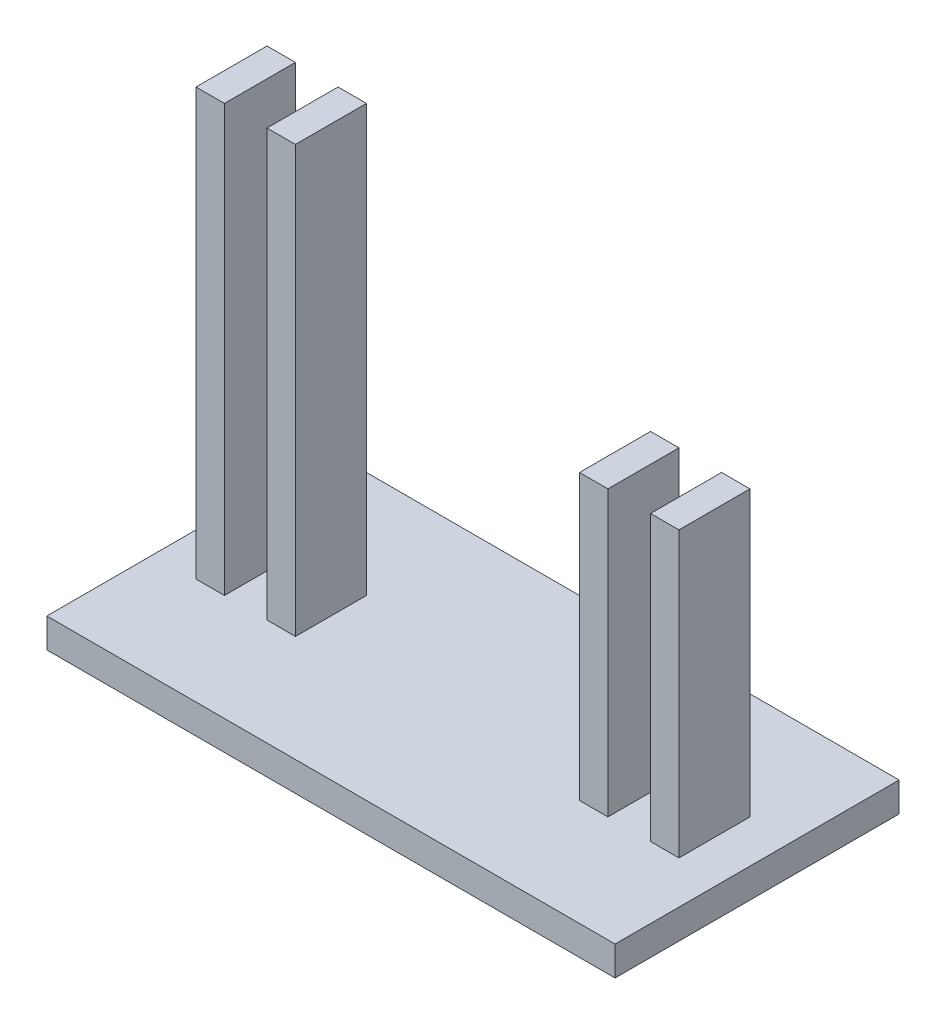
ISO-10303-21;
HEADER;
FILE_DESCRIPTION(('STEP AP214'),'2;1');
FILE_NAME('part.step','',(''),(''),'','','');
FILE_SCHEMA(('AUTOMOTIVE_DESIGN { 1 0 10303 214 1 1 1 1 }'));
ENDSEC;
DATA;
#1=APPLICATION_CONTEXT('core data for automotive mechanical design processes');
#2=APPLICATION_PROTOCOL_DEFINITION('international standard','automotive_design',2000,#1);
#3=PRODUCT_CONTEXT('',#1,'mechanical');
#4=PRODUCT('Part','Part','',(#3));
#5=PRODUCT_RELATED_PRODUCT_CATEGORY('part','',(#4));
#6=PRODUCT_DEFINITION_FORMATION('','',#4);
#7=PRODUCT_DEFINITION_CONTEXT('part definition',#1,'design');
#8=PRODUCT_DEFINITION('design','',#6,#7);
#9=PRODUCT_DEFINITION_SHAPE('','',#8);
#10=(LENGTH_UNIT() NAMED_UNIT(*) SI_UNIT(.MILLI.,.METRE.));
#11=(NAMED_UNIT(*) PLANE_ANGLE_UNIT() SI_UNIT($,.RADIAN.));
#12=(NAMED_UNIT(*) SI_UNIT($,.STERADIAN.) SOLID_ANGLE_UNIT());
#13=UNCERTAINTY_MEASURE_WITH_UNIT(LENGTH_MEASURE(1.E-05),#10,'distance_accuracy_value','');
#14=(GEOMETRIC_REPRESENTATION_CONTEXT(3) GLOBAL_UNCERTAINTY_ASSIGNED_CONTEXT((#13)) GLOBAL_UNIT_ASSIGNED_CONTEXT((#10,
#11,#12)) REPRESENTATION_CONTEXT('',''));
#15=CARTESIAN_POINT('',(0.,0.,0.));
#16=DIRECTION('',(0.,0.,1.));
#17=DIRECTION('',(1.,0.,0.));
#18=AXIS2_PLACEMENT_3D('',#15,#16,#17);
#19=CARTESIAN_POINT('',(0.,10.3577426791042,0.));
#20=DIRECTION('',(0.,1.,0.));
#21=DIRECTION('',(0.,0.,1.));
#22=AXIS2_PLACEMENT_3D('',#19,#20,#21);
#23=PLANE('',#22);
#24=DIRECTION('',(1.,0.,0.));
#25=VECTOR('',#24,1.);
#26=CARTESIAN_POINT('',(-100.,10.3577426791042,50.));
#27=LINE('',#26,#25);
#28=CARTESIAN_POINT('',(-100.,10.3577426791042,50.));
#29=VERTEX_POINT('',#28);
#30=CARTESIAN_POINT('',(100.,10.3577426791042,50.));
#31=VERTEX_POINT('',#30);
#32=EDGE_CURVE('E285',#29,#31,#27,.T.);
#33=ORIENTED_EDGE('',*,*,#32,.T.);
#34=DIRECTION('',(0.,0.,-1.));
#35=VECTOR('',#34,1.);
#36=CARTESIAN_POINT('',(100.,10.3577426791042,50.));
#37=LINE('',#36,#35);
#38=CARTESIAN_POINT('',(100.,10.3577426791042,-50.));
#39=VERTEX_POINT('',#38);
#40=EDGE_CURVE('E288',#31,#39,#37,.T.);
#41=ORIENTED_EDGE('',*,*,#40,.T.);
#42=DIRECTION('',(-1.,0.,0.));
#43=VECTOR('',#42,1.);
#44=CARTESIAN_POINT('',(-100.,10.3577426791042,-50.));
#45=LINE('',#44,#43);
#46=CARTESIAN_POINT('',(-100.,10.3577426791042,-50.));
#47=VERTEX_POINT('',#46);
#48=EDGE_CURVE('E291',#39,#47,#45,.T.);
#49=ORIENTED_EDGE('',*,*,#48,.T.);
#50=DIRECTION('',(0.,0.,1.));
#51=VECTOR('',#50,1.);
#52=CARTESIAN_POINT('',(-100.,10.3577426791042,-50.));
#53=LINE('',#52,#51);
#54=EDGE_CURVE('E293',#47,#29,#53,.T.);
#55=ORIENTED_EDGE('',*,*,#54,.T.);
#56=EDGE_LOOP('',(#33,#41,#49,#55));
#57=FACE_BOUND('',#56,.T.);
#58=DIRECTION('',(0.,0.,1.));
#59=VECTOR('',#58,1.);
#60=CARTESIAN_POINT('',(-85.,10.3577426791042,-12.5));
#61=LINE('',#60,#59);
#62=CARTESIAN_POINT('',(-85.,10.3577426791042,-12.5));
#63=VERTEX_POINT('',#62);
#64=CARTESIAN_POINT('',(-85.,10.3577426791042,12.5));
#65=VERTEX_POINT('',#64);
#66=EDGE_CURVE('E269',#63,#65,#61,.T.);
#67=ORIENTED_EDGE('',*,*,#66,.F.);
#68=DIRECTION('',(-1.,0.,0.));
#69=VECTOR('',#68,1.);
#70=CARTESIAN_POINT('',(-75.,10.3577426791042,-12.5));
#71=LINE('',#70,#69);
#72=CARTESIAN_POINT('',(-75.,10.3577426791042,-12.5));
#73=VERTEX_POINT('',#72);
#74=EDGE_CURVE('E255',#73,#63,#71,.T.);
#75=ORIENTED_EDGE('',*,*,#74,.F.);
#76=DIRECTION('',(0.,0.,-1.));
#77=VECTOR('',#76,1.);
#78=CARTESIAN_POINT('',(-75.,10.3577426791042,-12.5));
#79=LINE('',#78,#77);
#80=CARTESIAN_POINT('',(-75.,10.3577426791042,12.5));
#81=VERTEX_POINT('',#80);
#82=EDGE_CURVE('E260',#81,#73,#79,.T.);
#83=ORIENTED_EDGE('',*,*,#82,.F.);
#84=DIRECTION('',(1.,0.,0.));
#85=VECTOR('',#84,1.);
#86=CARTESIAN_POINT('',(-85.,10.3577426791042,12.5));
#87=LINE('',#86,#85);
#88=EDGE_CURVE('E271',#65,#81,#87,.T.);
#89=ORIENTED_EDGE('',*,*,#88,.F.);
#90=EDGE_LOOP('',(#67,#75,#83,#89));
#91=FACE_BOUND('',#90,.T.);
#92=DIRECTION('',(0.,0.,1.));
#93=VECTOR('',#92,1.);
#94=CARTESIAN_POINT('',(-60.,10.3577426791042,-12.5));
#95=LINE('',#94,#93);
#96=CARTESIAN_POINT('',(-60.,10.3577426791042,-12.5));
#97=VERTEX_POINT('',#96);
#98=CARTESIAN_POINT('',(-60.,10.3577426791042,12.5));
#99=VERTEX_POINT('',#98);
#100=EDGE_CURVE('E240',#97,#99,#95,.T.);
#101=ORIENTED_EDGE('',*,*,#100,.F.);
#102=DIRECTION('',(-1.,0.,0.));
#103=VECTOR('',#102,1.);
#104=CARTESIAN_POINT('',(-50.,10.3577426791042,-12.5));
#105=LINE('',#104,#103);
#106=CARTESIAN_POINT('',(-50.,10.3577426791042,-12.5));
#107=VERTEX_POINT('',#106);
#108=EDGE_CURVE('E226',#107,#97,#105,.T.);
#109=ORIENTED_EDGE('',*,*,#108,.F.);
#110=DIRECTION('',(0.,0.,-1.));
#111=VECTOR('',#110,1.);
#112=CARTESIAN_POINT('',(-50.,10.3577426791042,12.5));
#113=LINE('',#112,#111);
#114=CARTESIAN_POINT('',(-50.,10.3577426791042,12.5));
#115=VERTEX_POINT('',#114);
#116=EDGE_CURVE('E231',#115,#107,#113,.T.);
#117=ORIENTED_EDGE('',*,*,#116,.F.);
#118=DIRECTION('',(1.,0.,0.));
#119=VECTOR('',#118,1.);
#120=CARTESIAN_POINT('',(-60.,10.3577426791042,12.5));
#121=LINE('',#120,#119);
#122=EDGE_CURVE('E242',#99,#115,#121,.T.);
#123=ORIENTED_EDGE('',*,*,#122,.F.);
#124=EDGE_LOOP('',(#101,#109,#117,#123));
#125=FACE_BOUND('',#124,.T.);
#126=DIRECTION('',(0.,0.,1.));
#127=VECTOR('',#126,1.);
#128=CARTESIAN_POINT('',(75.,10.3577426791042,-12.5));
#129=LINE('',#128,#127);
#130=CARTESIAN_POINT('',(75.,10.3577426791042,-12.5));
#131=VERTEX_POINT('',#130);
#132=CARTESIAN_POINT('',(75.,10.3577426791042,12.5));
#133=VERTEX_POINT('',#132);
#134=EDGE_CURVE('E198',#131,#133,#129,.T.);
#135=ORIENTED_EDGE('',*,*,#134,.F.);
#136=DIRECTION('',(-1.,0.,0.));
#137=VECTOR('',#136,1.);
#138=CARTESIAN_POINT('',(85.,10.3577426791042,-12.5));
#139=LINE('',#138,#137);
#140=CARTESIAN_POINT('',(85.,10.3577426791042,-12.5));
#141=VERTEX_POINT('',#140);
#142=EDGE_CURVE('E195',#141,#131,#139,.T.);
#143=ORIENTED_EDGE('',*,*,#142,.F.);
#144=DIRECTION('',(0.,0.,-1.));
#145=VECTOR('',#144,1.);
#146=CARTESIAN_POINT('',(85.,10.3577426791042,-12.5));
#147=LINE('',#146,#145);
#148=CARTESIAN_POINT('',(85.,10.3577426791042,12.5));
#149=VERTEX_POINT('',#148);
#150=EDGE_CURVE('E207',#149,#141,#147,.T.);
#151=ORIENTED_EDGE('',*,*,#150,.F.);
#152=DIRECTION('',(1.,0.,0.));
#153=VECTOR('',#152,1.);
#154=CARTESIAN_POINT('',(85.,10.3577426791042,12.5));
#155=LINE('',#154,#153);
#156=EDGE_CURVE('E215',#133,#149,#155,.T.);
#157=ORIENTED_EDGE('',*,*,#156,.F.);
#158=EDGE_LOOP('',(#135,#143,#151,#157));
#159=FACE_BOUND('',#158,.T.);
#160=DIRECTION('',(0.,0.,-1.));
#161=VECTOR('',#160,1.);
#162=CARTESIAN_POINT('',(60.,10.3577426791042,12.5));
#163=LINE('',#162,#161);
#164=CARTESIAN_POINT('',(60.,10.3577426791042,12.5));
#165=VERTEX_POINT('',#164);
#166=CARTESIAN_POINT('',(60.,10.3577426791042,-12.5));
#167=VERTEX_POINT('',#166);
#168=EDGE_CURVE('E574',#165,#167,#163,.T.);
#169=ORIENTED_EDGE('',*,*,#168,.F.);
#170=DIRECTION('',(1.,0.,0.));
#171=VECTOR('',#170,1.);
#172=CARTESIAN_POINT('',(50.,10.3577426791042,12.5));
#173=LINE('',#172,#171);
#174=CARTESIAN_POINT('',(50.,10.3577426791042,12.5));
#175=VERTEX_POINT('',#174);
#176=EDGE_CURVE('E193',#175,#165,#173,.T.);
#177=ORIENTED_EDGE('',*,*,#176,.F.);
#178=DIRECTION('',(0.,0.,1.));
#179=VECTOR('',#178,1.);
#180=CARTESIAN_POINT('',(50.,10.3577426791042,-12.5));
#181=LINE('',#180,#179);
#182=CARTESIAN_POINT('',(50.,10.3577426791042,-12.5));
#183=VERTEX_POINT('',#182);
#184=EDGE_CURVE('E189',#183,#175,#181,.T.);
#185=ORIENTED_EDGE('',*,*,#184,.F.);
#186=DIRECTION('',(-1.,0.,0.));
#187=VECTOR('',#186,1.);
#188=CARTESIAN_POINT('',(60.,10.3577426791042,-12.5));
#189=LINE('',#188,#187);
#190=EDGE_CURVE('E571',#167,#183,#189,.T.);
#191=ORIENTED_EDGE('',*,*,#190,.F.);
#192=EDGE_LOOP('',(#169,#177,#185,#191));
#193=FACE_BOUND('',#192,.T.);
#194=ADVANCED_FACE('F32',(#57,#91,#125,#159,#193),#23,.T.);
#195=CARTESIAN_POINT('',(-100.,10.3577426791042,50.));
#196=DIRECTION('',(0.,0.,-1.));
#197=DIRECTION('',(-1.,0.,0.));
#198=AXIS2_PLACEMENT_3D('',#195,#196,#197);
#199=PLANE('',#198);
#200=DIRECTION('',(1.,0.,0.));
#201=VECTOR('',#200,1.);
#202=CARTESIAN_POINT('',(-100.,0.,50.));
#203=LINE('',#202,#201);
#204=CARTESIAN_POINT('',(-100.,0.,50.));
#205=VERTEX_POINT('',#204);
#206=CARTESIAN_POINT('',(100.,0.,50.));
#207=VERTEX_POINT('',#206);
#208=EDGE_CURVE('E284',#205,#207,#203,.T.);
#209=ORIENTED_EDGE('',*,*,#208,.T.);
#210=DIRECTION('',(0.,-1.,0.));
#211=VECTOR('',#210,1.);
#212=CARTESIAN_POINT('',(100.,10.3577426791042,50.));
#213=LINE('',#212,#211);
#214=EDGE_CURVE('E11',#31,#207,#213,.T.);
#215=ORIENTED_EDGE('',*,*,#214,.F.);
#216=ORIENTED_EDGE('',*,*,#32,.F.);
#217=DIRECTION('',(0.,-1.,0.));
#218=VECTOR('',#217,1.);
#219=CARTESIAN_POINT('',(-100.,10.3577426791042,50.));
#220=LINE('',#219,#218);
#221=EDGE_CURVE('E295',#29,#205,#220,.T.);
#222=ORIENTED_EDGE('',*,*,#221,.T.);
#223=EDGE_LOOP('',(#209,#215,#216,#222));
#224=FACE_BOUND('',#223,.T.);
#225=ADVANCED_FACE('F34',(#224),#199,.F.);
#226=CARTESIAN_POINT('',(100.,10.3577426791042,50.));
#227=DIRECTION('',(-1.,0.,0.));
#228=DIRECTION('',(0.,0.,1.));
#229=AXIS2_PLACEMENT_3D('',#226,#227,#228);
#230=PLANE('',#229);
#231=DIRECTION('',(0.,0.,-1.));
#232=VECTOR('',#231,1.);
#233=CARTESIAN_POINT('',(100.,0.,50.));
#234=LINE('',#233,#232);
#235=CARTESIAN_POINT('',(100.,0.,-50.));
#236=VERTEX_POINT('',#235);
#237=EDGE_CURVE('E298',#207,#236,#234,.T.);
#238=ORIENTED_EDGE('',*,*,#237,.T.);
#239=DIRECTION('',(0.,-1.,0.));
#240=VECTOR('',#239,1.);
#241=CARTESIAN_POINT('',(100.,10.3577426791042,-50.));
#242=LINE('',#241,#240);
#243=EDGE_CURVE('E40',#39,#236,#242,.T.);
#244=ORIENTED_EDGE('',*,*,#243,.F.);
#245=ORIENTED_EDGE('',*,*,#40,.F.);
#246=ORIENTED_EDGE('',*,*,#214,.T.);
#247=EDGE_LOOP('',(#238,#244,#245,#246));
#248=FACE_BOUND('',#247,.T.);
#249=ADVANCED_FACE('F328',(#248),#230,.F.);
#250=CARTESIAN_POINT('',(-100.,10.3577426791042,-50.));
#251=DIRECTION('',(0.,0.,1.));
#252=DIRECTION('',(1.,0.,0.));
#253=AXIS2_PLACEMENT_3D('',#250,#251,#252);
#254=PLANE('',#253);
#255=DIRECTION('',(-1.,0.,0.));
#256=VECTOR('',#255,1.);
#257=CARTESIAN_POINT('',(-100.,0.,-50.));
#258=LINE('',#257,#256);
#259=CARTESIAN_POINT('',(-100.,0.,-50.));
#260=VERTEX_POINT('',#259);
#261=EDGE_CURVE('E300',#236,#260,#258,.T.);
#262=ORIENTED_EDGE('',*,*,#261,.T.);
#263=DIRECTION('',(0.,-1.,0.));
#264=VECTOR('',#263,1.);
#265=CARTESIAN_POINT('',(-100.,10.3577426791042,-50.));
#266=LINE('',#265,#264);
#267=EDGE_CURVE('E305',#47,#260,#266,.T.);
#268=ORIENTED_EDGE('',*,*,#267,.F.);
#269=ORIENTED_EDGE('',*,*,#48,.F.);
#270=ORIENTED_EDGE('',*,*,#243,.T.);
#271=EDGE_LOOP('',(#262,#268,#269,#270));
#272=FACE_BOUND('',#271,.T.);
#273=ADVANCED_FACE('F312',(#272),#254,.F.);
#274=CARTESIAN_POINT('',(-100.,10.3577426791042,-50.));
#275=DIRECTION('',(1.,0.,0.));
#276=DIRECTION('',(0.,0.,-1.));
#277=AXIS2_PLACEMENT_3D('',#274,#275,#276);
#278=PLANE('',#277);
#279=DIRECTION('',(0.,0.,1.));
#280=VECTOR('',#279,1.);
#281=CARTESIAN_POINT('',(-100.,0.,-50.));
#282=LINE('',#281,#280);
#283=EDGE_CURVE('E289',#260,#205,#282,.T.);
#284=ORIENTED_EDGE('',*,*,#283,.T.);
#285=ORIENTED_EDGE('',*,*,#221,.F.);
#286=ORIENTED_EDGE('',*,*,#54,.F.);
#287=ORIENTED_EDGE('',*,*,#267,.T.);
#288=EDGE_LOOP('',(#284,#285,#286,#287));
#289=FACE_BOUND('',#288,.T.);
#290=ADVANCED_FACE('F321',(#289),#278,.F.);
#291=CARTESIAN_POINT('',(0.,0.,0.));
#292=DIRECTION('',(0.,1.,0.));
#293=DIRECTION('',(0.,0.,1.));
#294=AXIS2_PLACEMENT_3D('',#291,#292,#293);
#295=PLANE('',#294);
#296=ORIENTED_EDGE('',*,*,#208,.F.);
#297=ORIENTED_EDGE('',*,*,#283,.F.);
#298=ORIENTED_EDGE('',*,*,#261,.F.);
#299=ORIENTED_EDGE('',*,*,#237,.F.);
#300=EDGE_LOOP('',(#296,#297,#298,#299));
#301=FACE_BOUND('',#300,.T.);
#302=ADVANCED_FACE('F318',(#301),#295,.F.);
#303=CARTESIAN_POINT('',(-75.,160.357742679104,-12.5));
#304=DIRECTION('',(0.,0.,1.));
#305=DIRECTION('',(1.,0.,0.));
#306=AXIS2_PLACEMENT_3D('',#303,#304,#305);
#307=PLANE('',#306);
#308=ORIENTED_EDGE('',*,*,#74,.T.);
#309=DIRECTION('',(0.,-1.,0.));
#310=VECTOR('',#309,1.);
#311=CARTESIAN_POINT('',(-85.,160.357742679104,-12.5));
#312=LINE('',#311,#310);
#313=CARTESIAN_POINT('',(-85.,160.357742679104,-12.5));
#314=VERTEX_POINT('',#313);
#315=EDGE_CURVE('E282',#314,#63,#312,.T.);
#316=ORIENTED_EDGE('',*,*,#315,.F.);
#317=DIRECTION('',(-1.,0.,0.));
#318=VECTOR('',#317,1.);
#319=CARTESIAN_POINT('',(-75.,160.357742679104,-12.5));
#320=LINE('',#319,#318);
#321=CARTESIAN_POINT('',(-75.,160.357742679104,-12.5));
#322=VERTEX_POINT('',#321);
#323=EDGE_CURVE('E256',#322,#314,#320,.T.);
#324=ORIENTED_EDGE('',*,*,#323,.F.);
#325=DIRECTION('',(0.,-1.,0.));
#326=VECTOR('',#325,1.);
#327=CARTESIAN_POINT('',(-75.,160.357742679104,-12.5));
#328=LINE('',#327,#326);
#329=EDGE_CURVE('E266',#322,#73,#328,.T.);
#330=ORIENTED_EDGE('',*,*,#329,.T.);
#331=EDGE_LOOP('',(#308,#316,#324,#330));
#332=FACE_BOUND('',#331,.T.);
#333=ADVANCED_FACE('F341',(#332),#307,.F.);
#334=CARTESIAN_POINT('',(-85.,160.357742679104,-12.5));
#335=DIRECTION('',(1.,0.,0.));
#336=DIRECTION('',(0.,0.,-1.));
#337=AXIS2_PLACEMENT_3D('',#334,#335,#336);
#338=PLANE('',#337);
#339=ORIENTED_EDGE('',*,*,#66,.T.);
#340=DIRECTION('',(0.,-1.,0.));
#341=VECTOR('',#340,1.);
#342=CARTESIAN_POINT('',(-85.,160.357742679104,12.5));
#343=LINE('',#342,#341);
#344=CARTESIAN_POINT('',(-85.,160.357742679104,12.5));
#345=VERTEX_POINT('',#344);
#346=EDGE_CURVE('E279',#345,#65,#343,.T.);
#347=ORIENTED_EDGE('',*,*,#346,.F.);
#348=DIRECTION('',(0.,0.,1.));
#349=VECTOR('',#348,1.);
#350=CARTESIAN_POINT('',(-85.,160.357742679104,-12.5));
#351=LINE('',#350,#349);
#352=EDGE_CURVE('E259',#314,#345,#351,.T.);
#353=ORIENTED_EDGE('',*,*,#352,.F.);
#354=ORIENTED_EDGE('',*,*,#315,.T.);
#355=EDGE_LOOP('',(#339,#347,#353,#354));
#356=FACE_BOUND('',#355,.T.);
#357=ADVANCED_FACE('F360',(#356),#338,.F.);
#358=CARTESIAN_POINT('',(-85.,160.357742679104,12.5));
#359=DIRECTION('',(0.,0.,-1.));
#360=DIRECTION('',(-1.,0.,0.));
#361=AXIS2_PLACEMENT_3D('',#358,#359,#360);
#362=PLANE('',#361);
#363=ORIENTED_EDGE('',*,*,#88,.T.);
#364=DIRECTION('',(0.,-1.,0.));
#365=VECTOR('',#364,1.);
#366=CARTESIAN_POINT('',(-75.,160.357742679104,12.5));
#367=LINE('',#366,#365);
#368=CARTESIAN_POINT('',(-75.,160.357742679104,12.5));
#369=VERTEX_POINT('',#368);
#370=EDGE_CURVE('E277',#369,#81,#367,.T.);
#371=ORIENTED_EDGE('',*,*,#370,.F.);
#372=DIRECTION('',(1.,0.,0.));
#373=VECTOR('',#372,1.);
#374=CARTESIAN_POINT('',(-85.,160.357742679104,12.5));
#375=LINE('',#374,#373);
#376=EDGE_CURVE('E262',#345,#369,#375,.T.);
#377=ORIENTED_EDGE('',*,*,#376,.F.);
#378=ORIENTED_EDGE('',*,*,#346,.T.);
#379=EDGE_LOOP('',(#363,#371,#377,#378));
#380=FACE_BOUND('',#379,.T.);
#381=ADVANCED_FACE('F367',(#380),#362,.F.);
#382=CARTESIAN_POINT('',(-75.,160.357742679104,-12.5));
#383=DIRECTION('',(-1.,0.,0.));
#384=DIRECTION('',(0.,0.,1.));
#385=AXIS2_PLACEMENT_3D('',#382,#383,#384);
#386=PLANE('',#385);
#387=ORIENTED_EDGE('',*,*,#82,.T.);
#388=ORIENTED_EDGE('',*,*,#329,.F.);
#389=DIRECTION('',(0.,0.,-1.));
#390=VECTOR('',#389,1.);
#391=CARTESIAN_POINT('',(-75.,160.357742679104,-12.5));
#392=LINE('',#391,#390);
#393=EDGE_CURVE('E264',#369,#322,#392,.T.);
#394=ORIENTED_EDGE('',*,*,#393,.F.);
#395=ORIENTED_EDGE('',*,*,#370,.T.);
#396=EDGE_LOOP('',(#387,#388,#394,#395));
#397=FACE_BOUND('',#396,.T.);
#398=ADVANCED_FACE('F374',(#397),#386,.F.);
#399=CARTESIAN_POINT('',(0.,160.357742679104,0.));
#400=DIRECTION('',(0.,1.,0.));
#401=DIRECTION('',(0.,0.,1.));
#402=AXIS2_PLACEMENT_3D('',#399,#400,#401);
#403=PLANE('',#402);
#404=ORIENTED_EDGE('',*,*,#323,.T.);
#405=ORIENTED_EDGE('',*,*,#352,.T.);
#406=ORIENTED_EDGE('',*,*,#376,.T.);
#407=ORIENTED_EDGE('',*,*,#393,.T.);
#408=EDGE_LOOP('',(#404,#405,#406,#407));
#409=FACE_BOUND('',#408,.T.);
#410=ADVANCED_FACE('F382',(#409),#403,.T.);
#411=CARTESIAN_POINT('',(-50.,160.357742679104,-12.5));
#412=DIRECTION('',(0.,0.,1.));
#413=DIRECTION('',(1.,0.,0.));
#414=AXIS2_PLACEMENT_3D('',#411,#412,#413);
#415=PLANE('',#414);
#416=ORIENTED_EDGE('',*,*,#108,.T.);
#417=DIRECTION('',(0.,-1.,0.));
#418=VECTOR('',#417,1.);
#419=CARTESIAN_POINT('',(-60.,160.357742679104,-12.5));
#420=LINE('',#419,#418);
#421=CARTESIAN_POINT('',(-60.,160.357742679104,-12.5));
#422=VERTEX_POINT('',#421);
#423=EDGE_CURVE('E253',#422,#97,#420,.T.);
#424=ORIENTED_EDGE('',*,*,#423,.F.);
#425=DIRECTION('',(-1.,0.,0.));
#426=VECTOR('',#425,1.);
#427=CARTESIAN_POINT('',(-50.,160.357742679104,-12.5));
#428=LINE('',#427,#426);
#429=CARTESIAN_POINT('',(-50.,160.357742679104,-12.5));
#430=VERTEX_POINT('',#429);
#431=EDGE_CURVE('E227',#430,#422,#428,.T.);
#432=ORIENTED_EDGE('',*,*,#431,.F.);
#433=DIRECTION('',(0.,-1.,0.));
#434=VECTOR('',#433,1.);
#435=CARTESIAN_POINT('',(-50.,160.357742679104,-12.5));
#436=LINE('',#435,#434);
#437=EDGE_CURVE('E237',#430,#107,#436,.T.);
#438=ORIENTED_EDGE('',*,*,#437,.T.);
#439=EDGE_LOOP('',(#416,#424,#432,#438));
#440=FACE_BOUND('',#439,.T.);
#441=ADVANCED_FACE('F390',(#440),#415,.F.);
#442=CARTESIAN_POINT('',(-60.,160.357742679104,-12.5));
#443=DIRECTION('',(1.,0.,0.));
#444=DIRECTION('',(0.,0.,-1.));
#445=AXIS2_PLACEMENT_3D('',#442,#443,#444);
#446=PLANE('',#445);
#447=ORIENTED_EDGE('',*,*,#100,.T.);
#448=DIRECTION('',(0.,-1.,0.));
#449=VECTOR('',#448,1.);
#450=CARTESIAN_POINT('',(-60.,160.357742679104,12.5));
#451=LINE('',#450,#449);
#452=CARTESIAN_POINT('',(-60.,160.357742679104,12.5));
#453=VERTEX_POINT('',#452);
#454=EDGE_CURVE('E250',#453,#99,#451,.T.);
#455=ORIENTED_EDGE('',*,*,#454,.F.);
#456=DIRECTION('',(0.,0.,1.));
#457=VECTOR('',#456,1.);
#458=CARTESIAN_POINT('',(-60.,160.357742679104,-12.5));
#459=LINE('',#458,#457);
#460=EDGE_CURVE('E230',#422,#453,#459,.T.);
#461=ORIENTED_EDGE('',*,*,#460,.F.);
#462=ORIENTED_EDGE('',*,*,#423,.T.);
#463=EDGE_LOOP('',(#447,#455,#461,#462));
#464=FACE_BOUND('',#463,.T.);
#465=ADVANCED_FACE('F398',(#464),#446,.F.);
#466=CARTESIAN_POINT('',(-60.,160.357742679104,12.5));
#467=DIRECTION('',(0.,0.,-1.));
#468=DIRECTION('',(-1.,0.,0.));
#469=AXIS2_PLACEMENT_3D('',#466,#467,#468);
#470=PLANE('',#469);
#471=ORIENTED_EDGE('',*,*,#122,.T.);
#472=DIRECTION('',(0.,-1.,0.));
#473=VECTOR('',#472,1.);
#474=CARTESIAN_POINT('',(-50.,160.357742679104,12.5));
#475=LINE('',#474,#473);
#476=CARTESIAN_POINT('',(-50.,160.357742679104,12.5));
#477=VERTEX_POINT('',#476);
#478=EDGE_CURVE('E248',#477,#115,#475,.T.);
#479=ORIENTED_EDGE('',*,*,#478,.F.);
#480=DIRECTION('',(1.,0.,0.));
#481=VECTOR('',#480,1.);
#482=CARTESIAN_POINT('',(-60.,160.357742679104,12.5));
#483=LINE('',#482,#481);
#484=EDGE_CURVE('E233',#453,#477,#483,.T.);
#485=ORIENTED_EDGE('',*,*,#484,.F.);
#486=ORIENTED_EDGE('',*,*,#454,.T.);
#487=EDGE_LOOP('',(#471,#479,#485,#486));
#488=FACE_BOUND('',#487,.T.);
#489=ADVANCED_FACE('F406',(#488),#470,.F.);
#490=CARTESIAN_POINT('',(-50.,160.357742679104,12.5));
#491=DIRECTION('',(-1.,0.,0.));
#492=DIRECTION('',(0.,0.,1.));
#493=AXIS2_PLACEMENT_3D('',#490,#491,#492);
#494=PLANE('',#493);
#495=ORIENTED_EDGE('',*,*,#116,.T.);
#496=ORIENTED_EDGE('',*,*,#437,.F.);
#497=DIRECTION('',(0.,0.,-1.));
#498=VECTOR('',#497,1.);
#499=CARTESIAN_POINT('',(-50.,160.357742679104,12.5));
#500=LINE('',#499,#498);
#501=EDGE_CURVE('E235',#477,#430,#500,.T.);
#502=ORIENTED_EDGE('',*,*,#501,.F.);
#503=ORIENTED_EDGE('',*,*,#478,.T.);
#504=EDGE_LOOP('',(#495,#496,#502,#503));
#505=FACE_BOUND('',#504,.T.);
#506=ADVANCED_FACE('F414',(#505),#494,.F.);
#507=CARTESIAN_POINT('',(0.,160.357742679104,0.));
#508=DIRECTION('',(0.,1.,0.));
#509=DIRECTION('',(0.,0.,1.));
#510=AXIS2_PLACEMENT_3D('',#507,#508,#509);
#511=PLANE('',#510);
#512=ORIENTED_EDGE('',*,*,#431,.T.);
#513=ORIENTED_EDGE('',*,*,#460,.T.);
#514=ORIENTED_EDGE('',*,*,#484,.T.);
#515=ORIENTED_EDGE('',*,*,#501,.T.);
#516=EDGE_LOOP('',(#512,#513,#514,#515));
#517=FACE_BOUND('',#516,.T.);
#518=ADVANCED_FACE('F422',(#517),#511,.T.);
#519=CARTESIAN_POINT('',(85.,110.357742679104,-12.5));
#520=DIRECTION('',(0.,0.,1.));
#521=DIRECTION('',(1.,0.,0.));
#522=AXIS2_PLACEMENT_3D('',#519,#520,#521);
#523=PLANE('',#522);
#524=ORIENTED_EDGE('',*,*,#142,.T.);
#525=DIRECTION('',(0.,-1.,0.));
#526=VECTOR('',#525,1.);
#527=CARTESIAN_POINT('',(75.,110.357742679104,-12.5));
#528=LINE('',#527,#526);
#529=CARTESIAN_POINT('',(75.,110.357742679104,-12.5));
#530=VERTEX_POINT('',#529);
#531=EDGE_CURVE('E224',#530,#131,#528,.T.);
#532=ORIENTED_EDGE('',*,*,#531,.F.);
#533=DIRECTION('',(-1.,0.,0.));
#534=VECTOR('',#533,1.);
#535=CARTESIAN_POINT('',(85.,110.357742679104,-12.5));
#536=LINE('',#535,#534);
#537=CARTESIAN_POINT('',(85.,110.357742679104,-12.5));
#538=VERTEX_POINT('',#537);
#539=EDGE_CURVE('E203',#538,#530,#536,.T.);
#540=ORIENTED_EDGE('',*,*,#539,.F.);
#541=DIRECTION('',(0.,-1.,0.));
#542=VECTOR('',#541,1.);
#543=CARTESIAN_POINT('',(85.,110.357742679104,-12.5));
#544=LINE('',#543,#542);
#545=EDGE_CURVE('E212',#538,#141,#544,.T.);
#546=ORIENTED_EDGE('',*,*,#545,.T.);
#547=EDGE_LOOP('',(#524,#532,#540,#546));
#548=FACE_BOUND('',#547,.T.);
#549=ADVANCED_FACE('F430',(#548),#523,.F.);
#550=CARTESIAN_POINT('',(75.,110.357742679104,-12.5));
#551=DIRECTION('',(1.,0.,0.));
#552=DIRECTION('',(0.,0.,-1.));
#553=AXIS2_PLACEMENT_3D('',#550,#551,#552);
#554=PLANE('',#553);
#555=ORIENTED_EDGE('',*,*,#134,.T.);
#556=DIRECTION('',(0.,-1.,0.));
#557=VECTOR('',#556,1.);
#558=CARTESIAN_POINT('',(75.,110.357742679104,12.5));
#559=LINE('',#558,#557);
#560=CARTESIAN_POINT('',(75.,110.357742679104,12.5));
#561=VERTEX_POINT('',#560);
#562=EDGE_CURVE('E221',#561,#133,#559,.T.);
#563=ORIENTED_EDGE('',*,*,#562,.F.);
#564=DIRECTION('',(0.,0.,1.));
#565=VECTOR('',#564,1.);
#566=CARTESIAN_POINT('',(75.,110.357742679104,-12.5));
#567=LINE('',#566,#565);
#568=EDGE_CURVE('E206',#530,#561,#567,.T.);
#569=ORIENTED_EDGE('',*,*,#568,.F.);
#570=ORIENTED_EDGE('',*,*,#531,.T.);
#571=EDGE_LOOP('',(#555,#563,#569,#570));
#572=FACE_BOUND('',#571,.T.);
#573=ADVANCED_FACE('F438',(#572),#554,.F.);
#574=CARTESIAN_POINT('',(85.,110.357742679104,12.5));
#575=DIRECTION('',(0.,0.,-1.));
#576=DIRECTION('',(-1.,0.,0.));
#577=AXIS2_PLACEMENT_3D('',#574,#575,#576);
#578=PLANE('',#577);
#579=ORIENTED_EDGE('',*,*,#156,.T.);
#580=DIRECTION('',(0.,-1.,0.));
#581=VECTOR('',#580,1.);
#582=CARTESIAN_POINT('',(85.,110.357742679104,12.5));
#583=LINE('',#582,#581);
#584=CARTESIAN_POINT('',(85.,110.357742679104,12.5));
#585=VERTEX_POINT('',#584);
#586=EDGE_CURVE('E55',#585,#149,#583,.T.);
#587=ORIENTED_EDGE('',*,*,#586,.F.);
#588=DIRECTION('',(1.,0.,0.));
#589=VECTOR('',#588,1.);
#590=CARTESIAN_POINT('',(85.,110.357742679104,12.5));
#591=LINE('',#590,#589);
#592=EDGE_CURVE('E209',#561,#585,#591,.T.);
#593=ORIENTED_EDGE('',*,*,#592,.F.);
#594=ORIENTED_EDGE('',*,*,#562,.T.);
#595=EDGE_LOOP('',(#579,#587,#593,#594));
#596=FACE_BOUND('',#595,.T.);
#597=ADVANCED_FACE('F446',(#596),#578,.F.);
#598=CARTESIAN_POINT('',(85.,110.357742679104,-12.5));
#599=DIRECTION('',(-1.,0.,0.));
#600=DIRECTION('',(0.,0.,1.));
#601=AXIS2_PLACEMENT_3D('',#598,#599,#600);
#602=PLANE('',#601);
#603=ORIENTED_EDGE('',*,*,#150,.T.);
#604=ORIENTED_EDGE('',*,*,#545,.F.);
#605=DIRECTION('',(0.,0.,-1.));
#606=VECTOR('',#605,1.);
#607=CARTESIAN_POINT('',(85.,110.357742679104,-12.5));
#608=LINE('',#607,#606);
#609=EDGE_CURVE('E211',#585,#538,#608,.T.);
#610=ORIENTED_EDGE('',*,*,#609,.F.);
#611=ORIENTED_EDGE('',*,*,#586,.T.);
#612=EDGE_LOOP('',(#603,#604,#610,#611));
#613=FACE_BOUND('',#612,.T.);
#614=ADVANCED_FACE('F454',(#613),#602,.F.);
#615=CARTESIAN_POINT('',(0.,110.357742679104,0.));
#616=DIRECTION('',(0.,1.,0.));
#617=DIRECTION('',(0.,0.,1.));
#618=AXIS2_PLACEMENT_3D('',#615,#616,#617);
#619=PLANE('',#618);
#620=ORIENTED_EDGE('',*,*,#539,.T.);
#621=ORIENTED_EDGE('',*,*,#568,.T.);
#622=ORIENTED_EDGE('',*,*,#592,.T.);
#623=ORIENTED_EDGE('',*,*,#609,.T.);
#624=EDGE_LOOP('',(#620,#621,#622,#623));
#625=FACE_BOUND('',#624,.T.);
#626=ADVANCED_FACE('F462',(#625),#619,.T.);
#627=CARTESIAN_POINT('',(50.,110.357742679104,12.5));
#628=DIRECTION('',(0.,0.,-1.));
#629=DIRECTION('',(-1.,0.,0.));
#630=AXIS2_PLACEMENT_3D('',#627,#628,#629);
#631=PLANE('',#630);
#632=ORIENTED_EDGE('',*,*,#176,.T.);
#633=DIRECTION('',(0.,-1.,0.));
#634=VECTOR('',#633,1.);
#635=CARTESIAN_POINT('',(60.,110.357742679104,12.5));
#636=LINE('',#635,#634);
#637=CARTESIAN_POINT('',(60.,110.357742679104,12.5));
#638=VERTEX_POINT('',#637);
#639=EDGE_CURVE('E174',#638,#165,#636,.T.);
#640=ORIENTED_EDGE('',*,*,#639,.F.);
#641=DIRECTION('',(1.,0.,0.));
#642=VECTOR('',#641,1.);
#643=CARTESIAN_POINT('',(50.,110.357742679104,12.5));
#644=LINE('',#643,#642);
#645=CARTESIAN_POINT('',(50.,110.357742679104,12.5));
#646=VERTEX_POINT('',#645);
#647=EDGE_CURVE('E181',#646,#638,#644,.T.);
#648=ORIENTED_EDGE('',*,*,#647,.F.);
#649=DIRECTION('',(0.,-1.,0.));
#650=VECTOR('',#649,1.);
#651=CARTESIAN_POINT('',(50.,110.357742679104,12.5));
#652=LINE('',#651,#650);
#653=EDGE_CURVE('E568',#646,#175,#652,.T.);
#654=ORIENTED_EDGE('',*,*,#653,.T.);
#655=EDGE_LOOP('',(#632,#640,#648,#654));
#656=FACE_BOUND('',#655,.T.);
#657=ADVANCED_FACE('F191',(#656),#631,.F.);
#658=CARTESIAN_POINT('',(60.,110.357742679104,12.5));
#659=DIRECTION('',(-1.,0.,0.));
#660=DIRECTION('',(0.,0.,1.));
#661=AXIS2_PLACEMENT_3D('',#658,#659,#660);
#662=PLANE('',#661);
#663=ORIENTED_EDGE('',*,*,#168,.T.);
#664=DIRECTION('',(0.,-1.,0.));
#665=VECTOR('',#664,1.);
#666=CARTESIAN_POINT('',(60.,110.357742679104,-12.5));
#667=LINE('',#666,#665);
#668=CARTESIAN_POINT('',(60.,110.357742679104,-12.5));
#669=VERTEX_POINT('',#668);
#670=EDGE_CURVE('E177',#669,#167,#667,.T.);
#671=ORIENTED_EDGE('',*,*,#670,.F.);
#672=DIRECTION('',(0.,0.,-1.));
#673=VECTOR('',#672,1.);
#674=CARTESIAN_POINT('',(60.,110.357742679104,12.5));
#675=LINE('',#674,#673);
#676=EDGE_CURVE('E170',#638,#669,#675,.T.);
#677=ORIENTED_EDGE('',*,*,#676,.F.);
#678=ORIENTED_EDGE('',*,*,#639,.T.);
#679=EDGE_LOOP('',(#663,#671,#677,#678));
#680=FACE_BOUND('',#679,.T.);
#681=ADVANCED_FACE('F172',(#680),#662,.F.);
#682=CARTESIAN_POINT('',(60.,110.357742679104,-12.5));
#683=DIRECTION('',(0.,0.,1.));
#684=DIRECTION('',(1.,0.,0.));
#685=AXIS2_PLACEMENT_3D('',#682,#683,#684);
#686=PLANE('',#685);
#687=ORIENTED_EDGE('',*,*,#190,.T.);
#688=DIRECTION('',(0.,-1.,0.));
#689=VECTOR('',#688,1.);
#690=CARTESIAN_POINT('',(50.,110.357742679104,-12.5));
#691=LINE('',#690,#689);
#692=CARTESIAN_POINT('',(50.,110.357742679104,-12.5));
#693=VERTEX_POINT('',#692);
#694=EDGE_CURVE('E47',#693,#183,#691,.T.);
#695=ORIENTED_EDGE('',*,*,#694,.F.);
#696=DIRECTION('',(-1.,0.,0.));
#697=VECTOR('',#696,1.);
#698=CARTESIAN_POINT('',(60.,110.357742679104,-12.5));
#699=LINE('',#698,#697);
#700=EDGE_CURVE('E180',#669,#693,#699,.T.);
#701=ORIENTED_EDGE('',*,*,#700,.F.);
#702=ORIENTED_EDGE('',*,*,#670,.T.);
#703=EDGE_LOOP('',(#687,#695,#701,#702));
#704=FACE_BOUND('',#703,.T.);
#705=ADVANCED_FACE('F482',(#704),#686,.F.);
#706=CARTESIAN_POINT('',(50.,110.357742679104,-12.5));
#707=DIRECTION('',(1.,0.,0.));
#708=DIRECTION('',(0.,0.,-1.));
#709=AXIS2_PLACEMENT_3D('',#706,#707,#708);
#710=PLANE('',#709);
#711=ORIENTED_EDGE('',*,*,#184,.T.);
#712=ORIENTED_EDGE('',*,*,#653,.F.);
#713=DIRECTION('',(0.,0.,1.));
#714=VECTOR('',#713,1.);
#715=CARTESIAN_POINT('',(50.,110.357742679104,-12.5));
#716=LINE('',#715,#714);
#717=EDGE_CURVE('E185',#693,#646,#716,.T.);
#718=ORIENTED_EDGE('',*,*,#717,.F.);
#719=ORIENTED_EDGE('',*,*,#694,.T.);
#720=EDGE_LOOP('',(#711,#712,#718,#719));
#721=FACE_BOUND('',#720,.T.);
#722=ADVANCED_FACE('F489',(#721),#710,.F.);
#723=CARTESIAN_POINT('',(0.,110.357742679104,0.));
#724=DIRECTION('',(0.,1.,0.));
#725=DIRECTION('',(0.,0.,1.));
#726=AXIS2_PLACEMENT_3D('',#723,#724,#725);
#727=PLANE('',#726);
#728=ORIENTED_EDGE('',*,*,#647,.T.);
#729=ORIENTED_EDGE('',*,*,#676,.T.);
#730=ORIENTED_EDGE('',*,*,#700,.T.);
#731=ORIENTED_EDGE('',*,*,#717,.T.);
#732=EDGE_LOOP('',(#728,#729,#730,#731));
#733=FACE_BOUND('',#732,.T.);
#734=ADVANCED_FACE('F184',(#733),#727,.T.);
#735=CLOSED_SHELL('',(#194,#225,#249,#273,#290,#302,#333,#357,#381,#398,#410,#441,#465,#489,
#506,#518,#549,#573,#597,#614,#626,#657,#681,#705,#722,#734));
#736=MANIFOLD_SOLID_BREP('B2',#735);
#737=ADVANCED_BREP_SHAPE_REPRESENTATION('',(#18,#736),#14);
#738=SHAPE_DEFINITION_REPRESENTATION(#9,#737);
ENDSEC;
END-ISO-10303-21;
